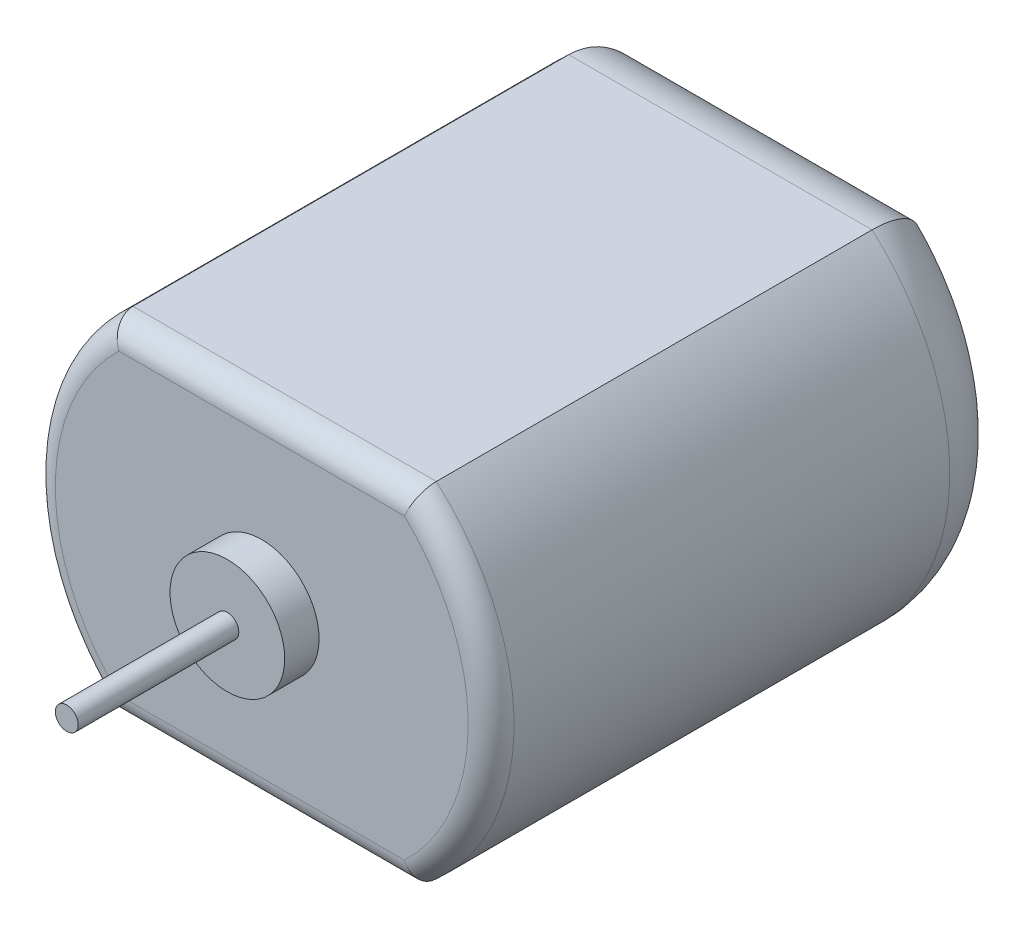
ISO-10303-21;
HEADER;
FILE_DESCRIPTION(('STEP AP214'),'2;1');
FILE_NAME('part.step','',(''),(''),'','','');
FILE_SCHEMA(('AUTOMOTIVE_DESIGN { 1 0 10303 214 1 1 1 1 }'));
ENDSEC;
DATA;
#1=APPLICATION_CONTEXT('core data for automotive mechanical design processes');
#2=APPLICATION_PROTOCOL_DEFINITION('international standard','automotive_design',2000,#1);
#3=PRODUCT_CONTEXT('',#1,'mechanical');
#4=PRODUCT('Part','Part','',(#3));
#5=PRODUCT_RELATED_PRODUCT_CATEGORY('part','',(#4));
#6=PRODUCT_DEFINITION_FORMATION('','',#4);
#7=PRODUCT_DEFINITION_CONTEXT('part definition',#1,'design');
#8=PRODUCT_DEFINITION('design','',#6,#7);
#9=PRODUCT_DEFINITION_SHAPE('','',#8);
#10=(LENGTH_UNIT() NAMED_UNIT(*) SI_UNIT(.MILLI.,.METRE.));
#11=(NAMED_UNIT(*) PLANE_ANGLE_UNIT() SI_UNIT($,.RADIAN.));
#12=(NAMED_UNIT(*) SI_UNIT($,.STERADIAN.) SOLID_ANGLE_UNIT());
#13=UNCERTAINTY_MEASURE_WITH_UNIT(LENGTH_MEASURE(1.E-05),#10,'distance_accuracy_value','');
#14=(GEOMETRIC_REPRESENTATION_CONTEXT(3) GLOBAL_UNCERTAINTY_ASSIGNED_CONTEXT((#13)) GLOBAL_UNIT_ASSIGNED_CONTEXT((#10,
#11,#12)) REPRESENTATION_CONTEXT('',''));
#15=CARTESIAN_POINT('',(0.,0.,0.));
#16=DIRECTION('',(0.,0.,1.));
#17=DIRECTION('',(1.,0.,0.));
#18=AXIS2_PLACEMENT_3D('',#15,#16,#17);
#19=CARTESIAN_POINT('',(0.,0.,0.));
#20=DIRECTION('',(0.,0.,1.));
#21=DIRECTION('',(1.,0.,0.));
#22=AXIS2_PLACEMENT_3D('',#19,#20,#21);
#23=PLANE('',#22);
#24=CARTESIAN_POINT('',(0.,0.,0.));
#25=DIRECTION('',(0.,0.,1.));
#26=DIRECTION('',(1.,0.,0.));
#27=AXIS2_PLACEMENT_3D('',#24,#25,#26);
#28=CIRCLE('',#27,7.);
#29=CARTESIAN_POINT('',(5.3619026473818,4.5,0.));
#30=VERTEX_POINT('',#29);
#31=CARTESIAN_POINT('',(5.3619026473818,-4.5,0.));
#32=VERTEX_POINT('',#31);
#33=EDGE_CURVE('E304',#30,#32,#28,.F.);
#34=ORIENTED_EDGE('',*,*,#33,.T.);
#35=DIRECTION('',(1.,0.,0.));
#36=VECTOR('',#35,1.);
#37=CARTESIAN_POINT('',(0.,-4.5,0.));
#38=LINE('',#37,#36);
#39=CARTESIAN_POINT('',(-5.3619026473818,-4.5,0.));
#40=VERTEX_POINT('',#39);
#41=EDGE_CURVE('E301',#32,#40,#38,.F.);
#42=ORIENTED_EDGE('',*,*,#41,.T.);
#43=CARTESIAN_POINT('',(0.,0.,0.));
#44=DIRECTION('',(0.,0.,1.));
#45=DIRECTION('',(1.,0.,0.));
#46=AXIS2_PLACEMENT_3D('',#43,#44,#45);
#47=CIRCLE('',#46,7.);
#48=CARTESIAN_POINT('',(-5.3619026473818,4.5,0.));
#49=VERTEX_POINT('',#48);
#50=EDGE_CURVE('E308',#40,#49,#47,.F.);
#51=ORIENTED_EDGE('',*,*,#50,.T.);
#52=DIRECTION('',(-1.,0.,0.));
#53=VECTOR('',#52,1.);
#54=CARTESIAN_POINT('',(0.,4.5,0.));
#55=LINE('',#54,#53);
#56=EDGE_CURVE('E306',#49,#30,#55,.F.);
#57=ORIENTED_EDGE('',*,*,#56,.T.);
#58=EDGE_LOOP('',(#34,#42,#51,#57));
#59=FACE_BOUND('',#58,.T.);
#60=CARTESIAN_POINT('',(0.,0.,0.));
#61=DIRECTION('',(0.,0.,-1.));
#62=DIRECTION('',(-1.,0.,0.));
#63=AXIS2_PLACEMENT_3D('',#60,#61,#62);
#64=CIRCLE('',#63,3.19234070505076);
#65=CARTESIAN_POINT('',(2.75858546553363,1.60662547174834,0.));
#66=VERTEX_POINT('',#65);
#67=CARTESIAN_POINT('',(-2.75858546553363,1.60662547174834,0.));
#68=VERTEX_POINT('',#67);
#69=EDGE_CURVE('E129',#66,#68,#64,.T.);
#70=ORIENTED_EDGE('',*,*,#69,.F.);
#71=DIRECTION('',(1.,0.,0.));
#72=VECTOR('',#71,1.);
#73=CARTESIAN_POINT('',(2.75858546553363,1.60662547174834,0.));
#74=LINE('',#73,#72);
#75=EDGE_CURVE('E134',#68,#66,#74,.T.);
#76=ORIENTED_EDGE('',*,*,#75,.F.);
#77=EDGE_LOOP('',(#70,#76));
#78=FACE_BOUND('',#77,.T.);
#79=ADVANCED_FACE('F39',(#59,#78),#23,.F.);
#80=CARTESIAN_POINT('',(0.,0.,23.));
#81=DIRECTION('',(0.,0.,-1.));
#82=DIRECTION('',(-1.,0.,0.));
#83=AXIS2_PLACEMENT_3D('',#80,#81,#82);
#84=CYLINDRICAL_SURFACE('',#83,10.);
#85=DIRECTION('',(0.,0.,-1.));
#86=VECTOR('',#85,1.);
#87=CARTESIAN_POINT('',(-6.61437827766148,7.5,23.));
#88=LINE('',#87,#86);
#89=CARTESIAN_POINT('',(-6.61437827766148,7.5,22.));
#90=VERTEX_POINT('',#89);
#91=CARTESIAN_POINT('',(-6.61437827766148,7.5,3.));
#92=VERTEX_POINT('',#91);
#93=EDGE_CURVE('E156',#90,#92,#88,.T.);
#94=ORIENTED_EDGE('',*,*,#93,.T.);
#95=CARTESIAN_POINT('',(0.,0.,3.));
#96=DIRECTION('',(0.,0.,1.));
#97=DIRECTION('',(1.,0.,0.));
#98=AXIS2_PLACEMENT_3D('',#95,#96,#97);
#99=CIRCLE('',#98,10.);
#100=CARTESIAN_POINT('',(-6.61437827766148,-7.5,3.));
#101=VERTEX_POINT('',#100);
#102=EDGE_CURVE('E290',#92,#101,#99,.T.);
#103=ORIENTED_EDGE('',*,*,#102,.T.);
#104=DIRECTION('',(0.,0.,-1.));
#105=VECTOR('',#104,1.);
#106=CARTESIAN_POINT('',(-6.61437827766148,-7.5,23.));
#107=LINE('',#106,#105);
#108=CARTESIAN_POINT('',(-6.61437827766148,-7.5,22.));
#109=VERTEX_POINT('',#108);
#110=EDGE_CURVE('E159',#109,#101,#107,.T.);
#111=ORIENTED_EDGE('',*,*,#110,.F.);
#112=CARTESIAN_POINT('',(0.,0.,22.));
#113=DIRECTION('',(0.,0.,1.));
#114=DIRECTION('',(1.,0.,0.));
#115=AXIS2_PLACEMENT_3D('',#112,#113,#114);
#116=CIRCLE('',#115,10.);
#117=EDGE_CURVE('E185',#109,#90,#116,.F.);
#118=ORIENTED_EDGE('',*,*,#117,.T.);
#119=EDGE_LOOP('',(#94,#103,#111,#118));
#120=FACE_BOUND('',#119,.T.);
#121=ADVANCED_FACE('F329',(#120),#84,.T.);
#122=CARTESIAN_POINT('',(6.61437827766148,-7.5,23.));
#123=DIRECTION('',(0.,1.,0.));
#124=DIRECTION('',(0.,0.,1.));
#125=AXIS2_PLACEMENT_3D('',#122,#123,#124);
#126=PLANE('',#125);
#127=ORIENTED_EDGE('',*,*,#110,.T.);
#128=DIRECTION('',(1.,0.,0.));
#129=VECTOR('',#128,1.);
#130=CARTESIAN_POINT('',(6.61437827766148,-7.5,3.));
#131=LINE('',#130,#129);
#132=CARTESIAN_POINT('',(6.61437827766147,-7.5,3.));
#133=VERTEX_POINT('',#132);
#134=EDGE_CURVE('E187',#101,#133,#131,.T.);
#135=ORIENTED_EDGE('',*,*,#134,.T.);
#136=DIRECTION('',(0.,0.,-1.));
#137=VECTOR('',#136,1.);
#138=CARTESIAN_POINT('',(6.61437827766147,-7.5,23.));
#139=LINE('',#138,#137);
#140=CARTESIAN_POINT('',(6.61437827766147,-7.5,22.));
#141=VERTEX_POINT('',#140);
#142=EDGE_CURVE('E165',#141,#133,#139,.T.);
#143=ORIENTED_EDGE('',*,*,#142,.F.);
#144=DIRECTION('',(1.,0.,0.));
#145=VECTOR('',#144,1.);
#146=CARTESIAN_POINT('',(-6.61437827766148,-7.5,22.));
#147=LINE('',#146,#145);
#148=EDGE_CURVE('E178',#141,#109,#147,.F.);
#149=ORIENTED_EDGE('',*,*,#148,.T.);
#150=EDGE_LOOP('',(#127,#135,#143,#149));
#151=FACE_BOUND('',#150,.T.);
#152=ADVANCED_FACE('F313',(#151),#126,.F.);
#153=CARTESIAN_POINT('',(0.,0.,23.));
#154=DIRECTION('',(0.,0.,-1.));
#155=DIRECTION('',(-1.,0.,0.));
#156=AXIS2_PLACEMENT_3D('',#153,#154,#155);
#157=CYLINDRICAL_SURFACE('',#156,10.);
#158=ORIENTED_EDGE('',*,*,#142,.T.);
#159=CARTESIAN_POINT('',(0.,0.,3.));
#160=DIRECTION('',(0.,0.,1.));
#161=DIRECTION('',(1.,0.,0.));
#162=AXIS2_PLACEMENT_3D('',#159,#160,#161);
#163=CIRCLE('',#162,10.);
#164=CARTESIAN_POINT('',(6.61437827766148,7.5,3.));
#165=VERTEX_POINT('',#164);
#166=EDGE_CURVE('E297',#133,#165,#163,.T.);
#167=ORIENTED_EDGE('',*,*,#166,.T.);
#168=DIRECTION('',(0.,0.,-1.));
#169=VECTOR('',#168,1.);
#170=CARTESIAN_POINT('',(6.61437827766148,7.5,23.));
#171=LINE('',#170,#169);
#172=CARTESIAN_POINT('',(6.61437827766148,7.5,22.));
#173=VERTEX_POINT('',#172);
#174=EDGE_CURVE('E162',#173,#165,#171,.T.);
#175=ORIENTED_EDGE('',*,*,#174,.F.);
#176=CARTESIAN_POINT('',(0.,0.,22.));
#177=DIRECTION('',(0.,0.,1.));
#178=DIRECTION('',(1.,0.,0.));
#179=AXIS2_PLACEMENT_3D('',#176,#177,#178);
#180=CIRCLE('',#179,10.);
#181=EDGE_CURVE('E181',#173,#141,#180,.F.);
#182=ORIENTED_EDGE('',*,*,#181,.T.);
#183=EDGE_LOOP('',(#158,#167,#175,#182));
#184=FACE_BOUND('',#183,.T.);
#185=ADVANCED_FACE('F318',(#184),#157,.T.);
#186=CARTESIAN_POINT('',(-6.61437827766148,7.5,23.));
#187=DIRECTION('',(0.,-1.,0.));
#188=DIRECTION('',(0.,0.,-1.));
#189=AXIS2_PLACEMENT_3D('',#186,#187,#188);
#190=PLANE('',#189);
#191=ORIENTED_EDGE('',*,*,#174,.T.);
#192=DIRECTION('',(-1.,0.,0.));
#193=VECTOR('',#192,1.);
#194=CARTESIAN_POINT('',(-6.61437827766148,7.5,3.));
#195=LINE('',#194,#193);
#196=EDGE_CURVE('E293',#165,#92,#195,.T.);
#197=ORIENTED_EDGE('',*,*,#196,.T.);
#198=ORIENTED_EDGE('',*,*,#93,.F.);
#199=DIRECTION('',(-1.,0.,0.));
#200=VECTOR('',#199,1.);
#201=CARTESIAN_POINT('',(6.61437827766148,7.5,22.));
#202=LINE('',#201,#200);
#203=EDGE_CURVE('E183',#90,#173,#202,.F.);
#204=ORIENTED_EDGE('',*,*,#203,.T.);
#205=EDGE_LOOP('',(#191,#197,#198,#204));
#206=FACE_BOUND('',#205,.T.);
#207=ADVANCED_FACE('F336',(#206),#190,.F.);
#208=CARTESIAN_POINT('',(0.,0.,23.));
#209=DIRECTION('',(0.,0.,1.));
#210=DIRECTION('',(1.,0.,0.));
#211=AXIS2_PLACEMENT_3D('',#208,#209,#210);
#212=PLANE('',#211);
#213=CARTESIAN_POINT('',(0.,0.,23.));
#214=DIRECTION('',(0.,0.,1.));
#215=DIRECTION('',(1.,0.,0.));
#216=AXIS2_PLACEMENT_3D('',#213,#214,#215);
#217=CIRCLE('',#216,9.);
#218=CARTESIAN_POINT('',(-6.22494979899436,6.5,23.));
#219=VERTEX_POINT('',#218);
#220=CARTESIAN_POINT('',(-6.22494979899436,-6.5,23.));
#221=VERTEX_POINT('',#220);
#222=EDGE_CURVE('E152',#219,#221,#217,.T.);
#223=ORIENTED_EDGE('',*,*,#222,.T.);
#224=DIRECTION('',(1.,0.,0.));
#225=VECTOR('',#224,1.);
#226=CARTESIAN_POINT('',(6.61437827766147,-6.5,23.));
#227=LINE('',#226,#225);
#228=CARTESIAN_POINT('',(6.22494979899436,-6.5,23.));
#229=VERTEX_POINT('',#228);
#230=EDGE_CURVE('E175',#221,#229,#227,.T.);
#231=ORIENTED_EDGE('',*,*,#230,.T.);
#232=CARTESIAN_POINT('',(0.,0.,23.));
#233=DIRECTION('',(0.,0.,1.));
#234=DIRECTION('',(1.,0.,0.));
#235=AXIS2_PLACEMENT_3D('',#232,#233,#234);
#236=CIRCLE('',#235,9.);
#237=CARTESIAN_POINT('',(6.22494979899436,6.5,23.));
#238=VERTEX_POINT('',#237);
#239=EDGE_CURVE('E173',#229,#238,#236,.T.);
#240=ORIENTED_EDGE('',*,*,#239,.T.);
#241=DIRECTION('',(-1.,0.,0.));
#242=VECTOR('',#241,1.);
#243=CARTESIAN_POINT('',(-6.61437827766148,6.5,23.));
#244=LINE('',#243,#242);
#245=EDGE_CURVE('E171',#238,#219,#244,.T.);
#246=ORIENTED_EDGE('',*,*,#245,.T.);
#247=EDGE_LOOP('',(#223,#231,#240,#246));
#248=FACE_BOUND('',#247,.T.);
#249=CARTESIAN_POINT('',(0.,0.,23.));
#250=DIRECTION('',(0.,0.,1.));
#251=DIRECTION('',(1.,0.,0.));
#252=AXIS2_PLACEMENT_3D('',#249,#250,#251);
#253=CIRCLE('',#252,2.5);
#254=CARTESIAN_POINT('',(2.5,0.,23.));
#255=VERTEX_POINT('',#254);
#256=EDGE_CURVE('E153',#255,#255,#253,.T.);
#257=ORIENTED_EDGE('',*,*,#256,.F.);
#258=EDGE_LOOP('',(#257));
#259=FACE_BOUND('',#258,.T.);
#260=ADVANCED_FACE('F342',(#248,#259),#212,.T.);
#261=CARTESIAN_POINT('',(0.,0.,24.5));
#262=DIRECTION('',(0.,0.,-1.));
#263=DIRECTION('',(-1.,0.,0.));
#264=AXIS2_PLACEMENT_3D('',#261,#262,#263);
#265=CYLINDRICAL_SURFACE('',#264,2.5);
#266=CARTESIAN_POINT('',(0.,0.,24.5));
#267=DIRECTION('',(0.,0.,1.));
#268=DIRECTION('',(1.,0.,0.));
#269=AXIS2_PLACEMENT_3D('',#266,#267,#268);
#270=CIRCLE('',#269,2.5);
#271=CARTESIAN_POINT('',(2.5,0.,24.5));
#272=VERTEX_POINT('',#271);
#273=EDGE_CURVE('E147',#272,#272,#270,.T.);
#274=ORIENTED_EDGE('',*,*,#273,.F.);
#275=EDGE_LOOP('',(#274));
#276=FACE_BOUND('',#275,.T.);
#277=ORIENTED_EDGE('',*,*,#256,.T.);
#278=EDGE_LOOP('',(#277));
#279=FACE_BOUND('',#278,.T.);
#280=ADVANCED_FACE('F345',(#276,#279),#265,.T.);
#281=CARTESIAN_POINT('',(0.,0.,24.5));
#282=DIRECTION('',(0.,0.,1.));
#283=DIRECTION('',(1.,0.,0.));
#284=AXIS2_PLACEMENT_3D('',#281,#282,#283);
#285=PLANE('',#284);
#286=CARTESIAN_POINT('',(0.,0.,24.5));
#287=DIRECTION('',(0.,0.,1.));
#288=DIRECTION('',(1.,0.,0.));
#289=AXIS2_PLACEMENT_3D('',#286,#287,#288);
#290=CIRCLE('',#289,0.5);
#291=CARTESIAN_POINT('',(0.5,0.,24.5));
#292=VERTEX_POINT('',#291);
#293=EDGE_CURVE('E149',#292,#292,#290,.T.);
#294=ORIENTED_EDGE('',*,*,#293,.F.);
#295=EDGE_LOOP('',(#294));
#296=FACE_BOUND('',#295,.T.);
#297=ORIENTED_EDGE('',*,*,#273,.T.);
#298=EDGE_LOOP('',(#297));
#299=FACE_BOUND('',#298,.T.);
#300=ADVANCED_FACE('F350',(#296,#299),#285,.T.);
#301=CARTESIAN_POINT('',(0.,0.,31.5));
#302=DIRECTION('',(0.,0.,-1.));
#303=DIRECTION('',(-1.,0.,0.));
#304=AXIS2_PLACEMENT_3D('',#301,#302,#303);
#305=CYLINDRICAL_SURFACE('',#304,0.5);
#306=CARTESIAN_POINT('',(0.,0.,31.5));
#307=DIRECTION('',(0.,0.,1.));
#308=DIRECTION('',(1.,0.,0.));
#309=AXIS2_PLACEMENT_3D('',#306,#307,#308);
#310=CIRCLE('',#309,0.5);
#311=CARTESIAN_POINT('',(0.5,0.,31.5));
#312=VERTEX_POINT('',#311);
#313=EDGE_CURVE('E144',#312,#312,#310,.T.);
#314=ORIENTED_EDGE('',*,*,#313,.F.);
#315=EDGE_LOOP('',(#314));
#316=FACE_BOUND('',#315,.T.);
#317=ORIENTED_EDGE('',*,*,#293,.T.);
#318=EDGE_LOOP('',(#317));
#319=FACE_BOUND('',#318,.T.);
#320=ADVANCED_FACE('F356',(#316,#319),#305,.T.);
#321=CARTESIAN_POINT('',(0.,0.,31.5));
#322=DIRECTION('',(0.,0.,1.));
#323=DIRECTION('',(1.,0.,0.));
#324=AXIS2_PLACEMENT_3D('',#321,#322,#323);
#325=PLANE('',#324);
#326=ORIENTED_EDGE('',*,*,#313,.T.);
#327=EDGE_LOOP('',(#326));
#328=FACE_BOUND('',#327,.T.);
#329=ADVANCED_FACE('F231',(#328),#325,.T.);
#330=CARTESIAN_POINT('',(0.,6.5,22.));
#331=DIRECTION('',(1.,0.,0.));
#332=DIRECTION('',(0.,0.,-1.));
#333=AXIS2_PLACEMENT_3D('',#330,#331,#332);
#334=CYLINDRICAL_SURFACE('',#333,1.);
#335=CARTESIAN_POINT('',(6.61437827766148,7.5,22.));
#336=CARTESIAN_POINT('',(6.61437842210405,7.50000070775486,22.0268030740604));
#337=CARTESIAN_POINT('',(6.61397070938767,7.49892164208524,22.0535928341524));
#338=CARTESIAN_POINT('',(6.61234564054267,7.49462277672622,22.1069707050066));
#339=CARTESIAN_POINT('',(6.61112842469291,7.49140334794055,22.1335588498995));
#340=CARTESIAN_POINT('',(6.60628204016919,7.47859025944818,22.2125990543511));
#341=CARTESIAN_POINT('',(6.60145803941141,7.46584151209883,22.2645050293058));
#342=CARTESIAN_POINT('',(6.58878872253936,7.43241945200209,22.3652610470786));
#343=CARTESIAN_POINT('',(6.58094379846614,7.41174716753527,22.4141114854738));
#344=CARTESIAN_POINT('',(6.56248668410333,7.36322931625037,22.5075492341123));
#345=CARTESIAN_POINT('',(6.55187375550575,7.33538183562103,22.5521354026067));
#346=CARTESIAN_POINT('',(6.52789298757729,7.27264796246685,22.6370836824597));
#347=CARTESIAN_POINT('',(6.5144608992878,7.23759790181229,22.6773064343941));
#348=CARTESIAN_POINT('',(6.48540284017042,7.16204782264177,22.7513264250274));
#349=CARTESIAN_POINT('',(6.46977617523093,7.12154608000981,22.785121622795));
#350=CARTESIAN_POINT('',(6.43571904228457,7.03363450295053,22.8475351466267));
#351=CARTESIAN_POINT('',(6.41717541093012,6.98595337277782,22.875709029581));
#352=CARTESIAN_POINT('',(6.37855287997911,6.88711287674907,22.9236673412623));
#353=CARTESIAN_POINT('',(6.35847359511584,6.83595263840904,22.9434496564989));
#354=CARTESIAN_POINT('',(6.32008383207697,6.73862844503145,22.9722513830427));
#355=CARTESIAN_POINT('',(6.30190425530877,6.69273143074326,22.9823687614689));
#356=CARTESIAN_POINT('',(6.26509673268577,6.60021995208261,22.9960597835253));
#357=CARTESIAN_POINT('',(6.24646973591242,6.55360707098906,22.9996462195082));
#358=CARTESIAN_POINT('',(6.22683898090258,6.5047045566649,22.9999917192456));
#359=CARTESIAN_POINT('',(6.22589445404307,6.50235216794491,23.0000000200304));
#360=CARTESIAN_POINT('',(6.22494979899436,6.5,23.));
#361=B_SPLINE_CURVE_WITH_KNOTS('',3,(#335,#336,#337,#338,#339,#340,#341,#342,#343,#344,#345,
#346,#347,#348,#349,#350,#351,#352,#353,#354,#355,#356,#357,#358,#359,#360),.UNSPECIFIED.,.F.,
.F.,(4,2,2,2,2,2,2,2,2,2,2,2,4),(0.,0.0803582131555719,0.16070250465756,0.320863669673694,
0.481004056736595,0.641187201698183,0.805520254521724,0.969905400968539,1.14436927926721,
1.31887707178089,1.46964837101099,1.62012403101409,1.62772879347805),.UNSPECIFIED.);
#362=EDGE_CURVE('E215',#173,#238,#361,.T.);
#363=ORIENTED_EDGE('',*,*,#362,.F.);
#364=ORIENTED_EDGE('',*,*,#203,.F.);
#365=CARTESIAN_POINT('',(-6.61437827766148,7.5,22.));
#366=CARTESIAN_POINT('',(-6.61437842210405,7.50000070775486,22.0268030740604));
#367=CARTESIAN_POINT('',(-6.61397070938767,7.49892164208524,22.0535928341524));
#368=CARTESIAN_POINT('',(-6.61234564054267,7.49462277672622,22.1069707050066));
#369=CARTESIAN_POINT('',(-6.61112842469291,7.49140334794055,22.1335588498995));
#370=CARTESIAN_POINT('',(-6.60628204016919,7.47859025944818,22.2125990543511));
#371=CARTESIAN_POINT('',(-6.60145803941141,7.46584151209883,22.2645050293058));
#372=CARTESIAN_POINT('',(-6.58878872253936,7.43241945200209,22.3652610470786));
#373=CARTESIAN_POINT('',(-6.58094379846614,7.41174716753527,22.4141114854738));
#374=CARTESIAN_POINT('',(-6.56248668410333,7.36322931625037,22.5075492341123));
#375=CARTESIAN_POINT('',(-6.55187375550575,7.33538183562103,22.5521354026067));
#376=CARTESIAN_POINT('',(-6.52789298757729,7.27264796246685,22.6370836824597));
#377=CARTESIAN_POINT('',(-6.5144608992878,7.23759790181229,22.6773064343941));
#378=CARTESIAN_POINT('',(-6.48540284017042,7.16204782264177,22.7513264250274));
#379=CARTESIAN_POINT('',(-6.46977617523093,7.12154608000981,22.785121622795));
#380=CARTESIAN_POINT('',(-6.43571904228457,7.03363450295053,22.8475351466267));
#381=CARTESIAN_POINT('',(-6.41717541093012,6.98595337277782,22.875709029581));
#382=CARTESIAN_POINT('',(-6.37855287997911,6.88711287674907,22.9236673412623));
#383=CARTESIAN_POINT('',(-6.35847359511584,6.83595263840904,22.9434496564989));
#384=CARTESIAN_POINT('',(-6.32008383207697,6.73862844503145,22.9722513830427));
#385=CARTESIAN_POINT('',(-6.30190425530877,6.69273143074326,22.9823687614689));
#386=CARTESIAN_POINT('',(-6.26509673268577,6.60021995208261,22.9960597835253));
#387=CARTESIAN_POINT('',(-6.24646973591242,6.55360707098906,22.9996462195082));
#388=CARTESIAN_POINT('',(-6.22683898090258,6.5047045566649,22.9999917192456));
#389=CARTESIAN_POINT('',(-6.22589445404307,6.50235216794491,23.0000000200304));
#390=CARTESIAN_POINT('',(-6.22494979899436,6.5,23.));
#391=B_SPLINE_CURVE_WITH_KNOTS('',3,(#365,#366,#367,#368,#369,#370,#371,#372,#373,#374,#375,
#376,#377,#378,#379,#380,#381,#382,#383,#384,#385,#386,#387,#388,#389,#390),.UNSPECIFIED.,.F.,
.F.,(4,2,2,2,2,2,2,2,2,2,2,2,4),(0.,0.0803582131555719,0.16070250465756,0.320863669673694,
0.481004056736595,0.641187201698183,0.805520254521724,0.969905400968539,1.14436927926721,
1.31887707178089,1.46964837101099,1.62012403101409,1.62772879347805),.UNSPECIFIED.);
#392=EDGE_CURVE('E148',#219,#90,#391,.F.);
#393=ORIENTED_EDGE('',*,*,#392,.F.);
#394=ORIENTED_EDGE('',*,*,#245,.F.);
#395=EDGE_LOOP('',(#363,#364,#393,#394));
#396=FACE_BOUND('',#395,.T.);
#397=ADVANCED_FACE('F227',(#396),#334,.T.);
#398=CARTESIAN_POINT('',(0.,0.,22.));
#399=DIRECTION('',(0.,0.,1.));
#400=DIRECTION('',(1.,0.,0.));
#401=AXIS2_PLACEMENT_3D('',#398,#399,#400);
#402=TOROIDAL_SURFACE('',#401,9.,1.);
#403=ORIENTED_EDGE('',*,*,#392,.T.);
#404=ORIENTED_EDGE('',*,*,#117,.F.);
#405=CARTESIAN_POINT('',(-6.61437827766148,-7.5,22.));
#406=CARTESIAN_POINT('',(-6.61437842210405,-7.50000070775486,22.0268030740604));
#407=CARTESIAN_POINT('',(-6.61397070938767,-7.49892164208524,22.0535928341524));
#408=CARTESIAN_POINT('',(-6.61234564054267,-7.49462277672622,22.1069707050066));
#409=CARTESIAN_POINT('',(-6.61112842469291,-7.49140334794055,22.1335588498995));
#410=CARTESIAN_POINT('',(-6.60628204016919,-7.47859025944818,22.2125990543511));
#411=CARTESIAN_POINT('',(-6.60145803941141,-7.46584151209883,22.2645050293058));
#412=CARTESIAN_POINT('',(-6.58878872253936,-7.43241945200209,22.3652610470786));
#413=CARTESIAN_POINT('',(-6.58094379846614,-7.41174716753527,22.4141114854738));
#414=CARTESIAN_POINT('',(-6.56248668410333,-7.36322931625037,22.5075492341123));
#415=CARTESIAN_POINT('',(-6.55187375550575,-7.33538183562103,22.5521354026067));
#416=CARTESIAN_POINT('',(-6.52789298757729,-7.27264796246685,22.6370836824597));
#417=CARTESIAN_POINT('',(-6.5144608992878,-7.23759790181229,22.6773064343941));
#418=CARTESIAN_POINT('',(-6.48540284017042,-7.16204782264177,22.7513264250274));
#419=CARTESIAN_POINT('',(-6.46977617523093,-7.12154608000981,22.785121622795));
#420=CARTESIAN_POINT('',(-6.43571904228457,-7.03363450295053,22.8475351466267));
#421=CARTESIAN_POINT('',(-6.41717541093012,-6.98595337277782,22.875709029581));
#422=CARTESIAN_POINT('',(-6.37855287997911,-6.88711287674907,22.9236673412623));
#423=CARTESIAN_POINT('',(-6.35847359511584,-6.83595263840904,22.9434496564989));
#424=CARTESIAN_POINT('',(-6.32008383207697,-6.73862844503145,22.9722513830427));
#425=CARTESIAN_POINT('',(-6.30190425530877,-6.69273143074326,22.9823687614689));
#426=CARTESIAN_POINT('',(-6.26509673268577,-6.60021995208261,22.9960597835253));
#427=CARTESIAN_POINT('',(-6.24646973591242,-6.55360707098906,22.9996462195082));
#428=CARTESIAN_POINT('',(-6.22683898090258,-6.5047045566649,22.9999917192456));
#429=CARTESIAN_POINT('',(-6.22589445404307,-6.50235216794491,23.0000000200304));
#430=CARTESIAN_POINT('',(-6.22494979899436,-6.5,23.));
#431=B_SPLINE_CURVE_WITH_KNOTS('',3,(#405,#406,#407,#408,#409,#410,#411,#412,#413,#414,#415,
#416,#417,#418,#419,#420,#421,#422,#423,#424,#425,#426,#427,#428,#429,#430),.UNSPECIFIED.,.F.,
.F.,(4,2,2,2,2,2,2,2,2,2,2,2,4),(0.,0.0803582131555719,0.16070250465756,0.320863669673694,
0.481004056736595,0.641187201698183,0.805520254521724,0.969905400968539,1.14436927926721,
1.31887707178089,1.46964837101099,1.62012403101409,1.62772879347805),.UNSPECIFIED.);
#432=EDGE_CURVE('E196',#221,#109,#431,.F.);
#433=ORIENTED_EDGE('',*,*,#432,.F.);
#434=ORIENTED_EDGE('',*,*,#222,.F.);
#435=EDGE_LOOP('',(#403,#404,#433,#434));
#436=FACE_BOUND('',#435,.T.);
#437=ADVANCED_FACE('F210',(#436),#402,.T.);
#438=CARTESIAN_POINT('',(0.,0.,22.));
#439=DIRECTION('',(0.,0.,1.));
#440=DIRECTION('',(1.,0.,0.));
#441=AXIS2_PLACEMENT_3D('',#438,#439,#440);
#442=TOROIDAL_SURFACE('',#441,9.,1.);
#443=ORIENTED_EDGE('',*,*,#362,.T.);
#444=ORIENTED_EDGE('',*,*,#239,.F.);
#445=CARTESIAN_POINT('',(6.61437827766147,-7.5,22.));
#446=CARTESIAN_POINT('',(6.61437842210405,-7.50000070775486,22.0268030740604));
#447=CARTESIAN_POINT('',(6.61397070938767,-7.49892164208524,22.0535928341524));
#448=CARTESIAN_POINT('',(6.61234564054267,-7.49462277672622,22.1069707050066));
#449=CARTESIAN_POINT('',(6.61112842469292,-7.49140334794055,22.1335588498995));
#450=CARTESIAN_POINT('',(6.60628204016919,-7.47859025944818,22.2125990543511));
#451=CARTESIAN_POINT('',(6.60145803941141,-7.46584151209883,22.2645050293058));
#452=CARTESIAN_POINT('',(6.58878872253936,-7.43241945200209,22.3652610470786));
#453=CARTESIAN_POINT('',(6.58094379846615,-7.41174716753527,22.4141114854738));
#454=CARTESIAN_POINT('',(6.56248668410333,-7.36322931625037,22.5075492341123));
#455=CARTESIAN_POINT('',(6.55187375550575,-7.33538183562103,22.5521354026067));
#456=CARTESIAN_POINT('',(6.52789298757729,-7.27264796246685,22.6370836824597));
#457=CARTESIAN_POINT('',(6.5144608992878,-7.23759790181229,22.6773064343941));
#458=CARTESIAN_POINT('',(6.48540284017042,-7.16204782264177,22.7513264250274));
#459=CARTESIAN_POINT('',(6.46977617523093,-7.12154608000981,22.785121622795));
#460=CARTESIAN_POINT('',(6.43571904228457,-7.03363450295053,22.8475351466267));
#461=CARTESIAN_POINT('',(6.41717541093012,-6.98595337277782,22.875709029581));
#462=CARTESIAN_POINT('',(6.37855287997911,-6.88711287674907,22.9236673412623));
#463=CARTESIAN_POINT('',(6.35847359511583,-6.83595263840905,22.9434496564989));
#464=CARTESIAN_POINT('',(6.32008383207698,-6.73862844503144,22.9722513830427));
#465=CARTESIAN_POINT('',(6.30190425530881,-6.69273143074324,22.9823687614689));
#466=CARTESIAN_POINT('',(6.26509673268573,-6.60021995208262,22.9960597835253));
#467=CARTESIAN_POINT('',(6.24646973591228,-6.55360707098911,22.9996462195082));
#468=CARTESIAN_POINT('',(6.22683898090256,-6.5047045566649,22.9999917192456));
#469=CARTESIAN_POINT('',(6.22589445404306,-6.50235216794491,23.0000000200304));
#470=CARTESIAN_POINT('',(6.22494979899436,-6.5,23.));
#471=B_SPLINE_CURVE_WITH_KNOTS('',3,(#445,#446,#447,#448,#449,#450,#451,#452,#453,#454,#455,
#456,#457,#458,#459,#460,#461,#462,#463,#464,#465,#466,#467,#468,#469,#470),.UNSPECIFIED.,.F.,
.F.,(4,2,2,2,2,2,2,2,2,2,2,2,4),(0.,0.0803582131555684,0.16070250465756,0.320863669673694,
0.481004056736595,0.641187201698183,0.805520254521723,0.969905400968539,1.14436927926721,
1.31887707178089,1.46964837101099,1.62012403101409,1.62772879347805),.UNSPECIFIED.);
#472=EDGE_CURVE('E188',#141,#229,#471,.T.);
#473=ORIENTED_EDGE('',*,*,#472,.F.);
#474=ORIENTED_EDGE('',*,*,#181,.F.);
#475=EDGE_LOOP('',(#443,#444,#473,#474));
#476=FACE_BOUND('',#475,.T.);
#477=ADVANCED_FACE('F207',(#476),#442,.T.);
#478=CARTESIAN_POINT('',(0.,-6.5,22.));
#479=DIRECTION('',(-1.,0.,0.));
#480=DIRECTION('',(0.,0.,1.));
#481=AXIS2_PLACEMENT_3D('',#478,#479,#480);
#482=CYLINDRICAL_SURFACE('',#481,1.);
#483=ORIENTED_EDGE('',*,*,#432,.T.);
#484=ORIENTED_EDGE('',*,*,#148,.F.);
#485=ORIENTED_EDGE('',*,*,#472,.T.);
#486=ORIENTED_EDGE('',*,*,#230,.F.);
#487=EDGE_LOOP('',(#483,#484,#485,#486));
#488=FACE_BOUND('',#487,.T.);
#489=ADVANCED_FACE('F204',(#488),#482,.T.);
#490=CARTESIAN_POINT('',(-6.61437827766148,4.5,3.));
#491=DIRECTION('',(-1.,0.,0.));
#492=DIRECTION('',(0.,0.,1.));
#493=AXIS2_PLACEMENT_3D('',#490,#491,#492);
#494=CYLINDRICAL_SURFACE('',#493,3.);
#495=CARTESIAN_POINT('',(6.61437827766148,7.5,3.));
#496=CARTESIAN_POINT('',(6.61438089711557,7.50001065237719,2.91974129677748));
#497=CARTESIAN_POINT('',(6.61316098831216,7.49677945199756,2.83948782628455));
#498=CARTESIAN_POINT('',(6.60829674839042,7.48391501598369,2.67958215168963));
#499=CARTESIAN_POINT('',(6.60465280659635,7.4742828084163,2.59992985311067));
#500=CARTESIAN_POINT('',(6.59497213826316,7.44872705953476,2.44197091842599));
#501=CARTESIAN_POINT('',(6.58894086984398,7.43281786948537,2.36366163495387));
#502=CARTESIAN_POINT('',(6.57453114161798,7.39488167008812,2.20878168433979));
#503=CARTESIAN_POINT('',(6.56615266060701,7.37285460547288,2.13221103291098));
#504=CARTESIAN_POINT('',(6.53756885552087,7.29788746549772,1.90592141390618));
#505=CARTESIAN_POINT('',(6.51390563783921,7.2360360367229,1.75946990527275));
#506=CARTESIAN_POINT('',(6.45797522988556,7.09093328812308,1.47947996205516));
#507=CARTESIAN_POINT('',(6.42570611779363,7.00767718847697,1.34594442087995));
#508=CARTESIAN_POINT('',(6.3524367425382,6.8204162448656,1.0918193667217));
#509=CARTESIAN_POINT('',(6.31124668358703,6.71596410370706,0.971614341525424));
#510=CARTESIAN_POINT('',(6.22153048143392,6.4910862431531,0.750450713773028));
#511=CARTESIAN_POINT('',(6.17300234194572,6.3706561781438,0.649497365484664));
#512=CARTESIAN_POINT('',(6.06645683671531,6.10977898103353,0.46310463613895));
#513=CARTESIAN_POINT('',(6.00804329933791,5.96856207458035,0.378971057190533));
#514=CARTESIAN_POINT('',(5.88523123678406,5.67643584500728,0.235494056444307));
#515=CARTESIAN_POINT('',(5.82083026032197,5.52552256002477,0.176160843152402));
#516=CARTESIAN_POINT('',(5.6928912372995,5.23105267770871,0.0867127456439242));
#517=CARTESIAN_POINT('',(5.62973206222385,5.08793744269847,0.0545681023797194));
#518=CARTESIAN_POINT('',(5.50043124519766,4.8001160777803,0.0115157269256712));
#519=CARTESIAN_POINT('',(5.43429562873955,4.65541357403447,0.000566904328327853));
#520=CARTESIAN_POINT('',(5.36542798752529,4.50756286613625,7.13218261032609E-06));
#521=CARTESIAN_POINT('',(5.36366564659822,4.5037812004739,-1.73816043331068E-08));
#522=CARTESIAN_POINT('',(5.3619026473818,4.5,0.));
#523=B_SPLINE_CURVE_WITH_KNOTS('',3,(#495,#496,#497,#498,#499,#500,#501,#502,#503,#504,#505,
#506,#507,#508,#509,#510,#511,#512,#513,#514,#515,#516,#517,#518,#519,#520,#521,#522),
.UNSPECIFIED.,.F.,.F.,(4,2,2,2,2,2,2,2,2,2,2,2,2,4),(0.,0.240692780134945,0.481346911902001,
0.721453987517645,0.961563232272681,1.44131597574978,1.92117594475226,2.41247478495634,
2.90390752168917,3.4250310336882,3.9463688435722,4.42407459823595,4.90085333719839,
4.9133697773285),.UNSPECIFIED.);
#524=EDGE_CURVE('E252',#30,#165,#523,.F.);
#525=ORIENTED_EDGE('',*,*,#524,.F.);
#526=ORIENTED_EDGE('',*,*,#56,.F.);
#527=CARTESIAN_POINT('',(-6.61437827766148,7.5,3.));
#528=CARTESIAN_POINT('',(-6.61438089711557,7.50001065237719,2.91974129677748));
#529=CARTESIAN_POINT('',(-6.61316098831216,7.49677945199756,2.83948782628455));
#530=CARTESIAN_POINT('',(-6.60829674839042,7.48391501598369,2.67958215168963));
#531=CARTESIAN_POINT('',(-6.60465280659635,7.4742828084163,2.59992985311067));
#532=CARTESIAN_POINT('',(-6.59497213826316,7.44872705953476,2.44197091842599));
#533=CARTESIAN_POINT('',(-6.58894086984398,7.43281786948537,2.36366163495387));
#534=CARTESIAN_POINT('',(-6.57453114161798,7.39488167008812,2.20878168433979));
#535=CARTESIAN_POINT('',(-6.56615266060701,7.37285460547288,2.13221103291098));
#536=CARTESIAN_POINT('',(-6.53756885552087,7.29788746549772,1.90592141390618));
#537=CARTESIAN_POINT('',(-6.51390563783921,7.2360360367229,1.75946990527275));
#538=CARTESIAN_POINT('',(-6.45797522988556,7.09093328812308,1.47947996205516));
#539=CARTESIAN_POINT('',(-6.42570611779363,7.00767718847697,1.34594442087995));
#540=CARTESIAN_POINT('',(-6.3524367425382,6.8204162448656,1.0918193667217));
#541=CARTESIAN_POINT('',(-6.31124668358703,6.71596410370706,0.971614341525424));
#542=CARTESIAN_POINT('',(-6.22153048143392,6.4910862431531,0.750450713773028));
#543=CARTESIAN_POINT('',(-6.17300234194572,6.3706561781438,0.649497365484664));
#544=CARTESIAN_POINT('',(-6.06645683671531,6.10977898103353,0.46310463613895));
#545=CARTESIAN_POINT('',(-6.00804329933791,5.96856207458035,0.378971057190533));
#546=CARTESIAN_POINT('',(-5.88523123678406,5.67643584500728,0.235494056444307));
#547=CARTESIAN_POINT('',(-5.82083026032197,5.52552256002477,0.176160843152402));
#548=CARTESIAN_POINT('',(-5.6928912372995,5.23105267770871,0.0867127456439242));
#549=CARTESIAN_POINT('',(-5.62973206222385,5.08793744269847,0.0545681023797194));
#550=CARTESIAN_POINT('',(-5.50043124519766,4.8001160777803,0.0115157269256712));
#551=CARTESIAN_POINT('',(-5.43429562873955,4.65541357403447,0.000566904328327853));
#552=CARTESIAN_POINT('',(-5.36542798752529,4.50756286613625,7.13218261032609E-06));
#553=CARTESIAN_POINT('',(-5.36366564659822,4.5037812004739,-1.73816043331068E-08));
#554=CARTESIAN_POINT('',(-5.3619026473818,4.5,0.));
#555=B_SPLINE_CURVE_WITH_KNOTS('',3,(#527,#528,#529,#530,#531,#532,#533,#534,#535,#536,#537,
#538,#539,#540,#541,#542,#543,#544,#545,#546,#547,#548,#549,#550,#551,#552,#553,#554),
.UNSPECIFIED.,.F.,.F.,(4,2,2,2,2,2,2,2,2,2,2,2,2,4),(0.,0.240692780134945,0.481346911902001,
0.721453987517645,0.961563232272681,1.44131597574978,1.92117594475226,2.41247478495634,
2.90390752168917,3.4250310336882,3.9463688435722,4.42407459823595,4.90085333719839,
4.9133697773285),.UNSPECIFIED.);
#556=EDGE_CURVE('E197',#92,#49,#555,.T.);
#557=ORIENTED_EDGE('',*,*,#556,.F.);
#558=ORIENTED_EDGE('',*,*,#196,.F.);
#559=EDGE_LOOP('',(#525,#526,#557,#558));
#560=FACE_BOUND('',#559,.T.);
#561=ADVANCED_FACE('F270',(#560),#494,.T.);
#562=CARTESIAN_POINT('',(0.,0.,3.));
#563=DIRECTION('',(0.,0.,1.));
#564=DIRECTION('',(1.,0.,0.));
#565=AXIS2_PLACEMENT_3D('',#562,#563,#564);
#566=TOROIDAL_SURFACE('',#565,7.,3.);
#567=ORIENTED_EDGE('',*,*,#556,.T.);
#568=ORIENTED_EDGE('',*,*,#50,.F.);
#569=CARTESIAN_POINT('',(-6.61437827766148,-7.5,3.));
#570=CARTESIAN_POINT('',(-6.61438089711557,-7.50001065237719,2.91974129677748));
#571=CARTESIAN_POINT('',(-6.61316098831216,-7.49677945199756,2.83948782628455));
#572=CARTESIAN_POINT('',(-6.60829674839042,-7.48391501598369,2.67958215168963));
#573=CARTESIAN_POINT('',(-6.60465280659635,-7.4742828084163,2.59992985311067));
#574=CARTESIAN_POINT('',(-6.59497213826316,-7.44872705953476,2.44197091842599));
#575=CARTESIAN_POINT('',(-6.58894086984398,-7.43281786948537,2.36366163495387));
#576=CARTESIAN_POINT('',(-6.57453114161798,-7.39488167008812,2.20878168433979));
#577=CARTESIAN_POINT('',(-6.56615266060701,-7.37285460547288,2.13221103291098));
#578=CARTESIAN_POINT('',(-6.53756885552087,-7.29788746549772,1.90592141390618));
#579=CARTESIAN_POINT('',(-6.51390563783921,-7.2360360367229,1.75946990527275));
#580=CARTESIAN_POINT('',(-6.45797522988556,-7.09093328812308,1.47947996205516));
#581=CARTESIAN_POINT('',(-6.42570611779363,-7.00767718847697,1.34594442087995));
#582=CARTESIAN_POINT('',(-6.3524367425382,-6.8204162448656,1.0918193667217));
#583=CARTESIAN_POINT('',(-6.31124668358703,-6.71596410370706,0.971614341525424));
#584=CARTESIAN_POINT('',(-6.22153048143392,-6.4910862431531,0.750450713773028));
#585=CARTESIAN_POINT('',(-6.17300234194572,-6.3706561781438,0.649497365484664));
#586=CARTESIAN_POINT('',(-6.06645683671531,-6.10977898103353,0.46310463613895));
#587=CARTESIAN_POINT('',(-6.00804329933791,-5.96856207458035,0.378971057190533));
#588=CARTESIAN_POINT('',(-5.88523123678406,-5.67643584500728,0.235494056444307));
#589=CARTESIAN_POINT('',(-5.82083026032197,-5.52552256002477,0.176160843152402));
#590=CARTESIAN_POINT('',(-5.6928912372995,-5.23105267770871,0.0867127456439242));
#591=CARTESIAN_POINT('',(-5.62973206222385,-5.08793744269847,0.0545681023797194));
#592=CARTESIAN_POINT('',(-5.50043124519766,-4.8001160777803,0.0115157269256712));
#593=CARTESIAN_POINT('',(-5.43429562873955,-4.65541357403447,0.000566904328327853));
#594=CARTESIAN_POINT('',(-5.36542798752529,-4.50756286613625,7.13218261032609E-06));
#595=CARTESIAN_POINT('',(-5.36366564659822,-4.5037812004739,-1.73816043331068E-08));
#596=CARTESIAN_POINT('',(-5.3619026473818,-4.5,0.));
#597=B_SPLINE_CURVE_WITH_KNOTS('',3,(#569,#570,#571,#572,#573,#574,#575,#576,#577,#578,#579,
#580,#581,#582,#583,#584,#585,#586,#587,#588,#589,#590,#591,#592,#593,#594,#595,#596),
.UNSPECIFIED.,.F.,.F.,(4,2,2,2,2,2,2,2,2,2,2,2,2,4),(0.,0.240692780134945,0.481346911902001,
0.721453987517645,0.961563232272681,1.44131597574978,1.92117594475226,2.41247478495634,
2.90390752168917,3.4250310336882,3.9463688435722,4.42407459823595,4.90085333719839,
4.9133697773285),.UNSPECIFIED.);
#598=EDGE_CURVE('E260',#101,#40,#597,.T.);
#599=ORIENTED_EDGE('',*,*,#598,.F.);
#600=ORIENTED_EDGE('',*,*,#102,.F.);
#601=EDGE_LOOP('',(#567,#568,#599,#600));
#602=FACE_BOUND('',#601,.T.);
#603=ADVANCED_FACE('F239',(#602),#566,.T.);
#604=CARTESIAN_POINT('',(0.,0.,3.));
#605=DIRECTION('',(0.,0.,1.));
#606=DIRECTION('',(1.,0.,0.));
#607=AXIS2_PLACEMENT_3D('',#604,#605,#606);
#608=TOROIDAL_SURFACE('',#607,7.,3.);
#609=ORIENTED_EDGE('',*,*,#524,.T.);
#610=ORIENTED_EDGE('',*,*,#166,.F.);
#611=CARTESIAN_POINT('',(6.61437827766147,-7.5,3.));
#612=CARTESIAN_POINT('',(6.61438089711557,-7.50001065237719,2.91974129677748));
#613=CARTESIAN_POINT('',(6.61316098831216,-7.49677945199756,2.83948782628455));
#614=CARTESIAN_POINT('',(6.60829674839042,-7.48391501598369,2.67958215168963));
#615=CARTESIAN_POINT('',(6.60465280659635,-7.4742828084163,2.59992985311067));
#616=CARTESIAN_POINT('',(6.59497213826316,-7.44872705953476,2.44197091842599));
#617=CARTESIAN_POINT('',(6.58894086984399,-7.43281786948537,2.36366163495387));
#618=CARTESIAN_POINT('',(6.57453114161799,-7.39488167008812,2.20878168433979));
#619=CARTESIAN_POINT('',(6.56615266060701,-7.37285460547288,2.13221103291098));
#620=CARTESIAN_POINT('',(6.53756885552087,-7.29788746549772,1.90592141390618));
#621=CARTESIAN_POINT('',(6.51390563783921,-7.2360360367229,1.75946990527275));
#622=CARTESIAN_POINT('',(6.45797522988556,-7.09093328812308,1.47947996205516));
#623=CARTESIAN_POINT('',(6.42570611779363,-7.00767718847697,1.34594442087995));
#624=CARTESIAN_POINT('',(6.3524367425382,-6.8204162448656,1.0918193667217));
#625=CARTESIAN_POINT('',(6.31124668358702,-6.71596410370706,0.971614341525424));
#626=CARTESIAN_POINT('',(6.22153048143392,-6.4910862431531,0.750450713773028));
#627=CARTESIAN_POINT('',(6.17300234194572,-6.3706561781438,0.649497365484664));
#628=CARTESIAN_POINT('',(6.06645683671531,-6.10977898103353,0.46310463613895));
#629=CARTESIAN_POINT('',(6.0080432993379,-5.96856207458035,0.378971057190533));
#630=CARTESIAN_POINT('',(5.88523123678405,-5.67643584500728,0.235494056444307));
#631=CARTESIAN_POINT('',(5.82083026032197,-5.52552256002477,0.176160843152402));
#632=CARTESIAN_POINT('',(5.6928912372995,-5.23105267770871,0.0867127456439241));
#633=CARTESIAN_POINT('',(5.62973206222385,-5.08793744269847,0.0545681023797195));
#634=CARTESIAN_POINT('',(5.50043124519767,-4.80011607778029,0.0115157269256706));
#635=CARTESIAN_POINT('',(5.43429562873955,-4.65541357403447,0.000566904328326431));
#636=CARTESIAN_POINT('',(5.36542798752529,-4.50756286613625,7.13218261025252E-06));
#637=CARTESIAN_POINT('',(5.36366564659822,-4.5037812004739,-1.73816043706715E-08));
#638=CARTESIAN_POINT('',(5.3619026473818,-4.5,0.));
#639=B_SPLINE_CURVE_WITH_KNOTS('',3,(#611,#612,#613,#614,#615,#616,#617,#618,#619,#620,#621,
#622,#623,#624,#625,#626,#627,#628,#629,#630,#631,#632,#633,#634,#635,#636,#637,#638),
.UNSPECIFIED.,.F.,.F.,(4,2,2,2,2,2,2,2,2,2,2,2,2,4),(0.,0.240692780134944,0.481346911902,
0.721453987517644,0.961563232272681,1.44131597574978,1.92117594475226,2.41247478495634,
2.90390752168917,3.4250310336882,3.9463688435722,4.42407459823595,4.90085333719839,
4.9133697773285),.UNSPECIFIED.);
#640=EDGE_CURVE('E143',#32,#133,#639,.F.);
#641=ORIENTED_EDGE('',*,*,#640,.F.);
#642=ORIENTED_EDGE('',*,*,#33,.F.);
#643=EDGE_LOOP('',(#609,#610,#641,#642));
#644=FACE_BOUND('',#643,.T.);
#645=ADVANCED_FACE('F233',(#644),#608,.T.);
#646=CARTESIAN_POINT('',(6.61437827766148,-4.5,3.));
#647=DIRECTION('',(1.,0.,0.));
#648=DIRECTION('',(0.,0.,-1.));
#649=AXIS2_PLACEMENT_3D('',#646,#647,#648);
#650=CYLINDRICAL_SURFACE('',#649,3.);
#651=ORIENTED_EDGE('',*,*,#598,.T.);
#652=ORIENTED_EDGE('',*,*,#41,.F.);
#653=ORIENTED_EDGE('',*,*,#640,.T.);
#654=ORIENTED_EDGE('',*,*,#134,.F.);
#655=EDGE_LOOP('',(#651,#652,#653,#654));
#656=FACE_BOUND('',#655,.T.);
#657=ADVANCED_FACE('F238',(#656),#650,.T.);
#658=CARTESIAN_POINT('',(0.,0.,-1.));
#659=DIRECTION('',(0.,0.,1.));
#660=DIRECTION('',(1.,0.,0.));
#661=AXIS2_PLACEMENT_3D('',#658,#659,#660);
#662=CYLINDRICAL_SURFACE('',#661,3.19234070505076);
#663=DIRECTION('',(0.,0.,1.));
#664=VECTOR('',#663,1.);
#665=CARTESIAN_POINT('',(-2.75858546553363,1.60662547174834,-1.));
#666=LINE('',#665,#664);
#667=CARTESIAN_POINT('',(-2.75858546553363,1.60662547174834,-0.5));
#668=VERTEX_POINT('',#667);
#669=EDGE_CURVE('E133',#668,#68,#666,.T.);
#670=ORIENTED_EDGE('',*,*,#669,.F.);
#671=CARTESIAN_POINT('',(0.,0.,-0.5));
#672=DIRECTION('',(0.,0.,-1.));
#673=DIRECTION('',(-1.,0.,0.));
#674=AXIS2_PLACEMENT_3D('',#671,#672,#673);
#675=CIRCLE('',#674,3.19234070505076);
#676=CARTESIAN_POINT('',(2.75858546553363,1.60662547174834,-0.5));
#677=VERTEX_POINT('',#676);
#678=EDGE_CURVE('E11',#668,#677,#675,.F.);
#679=ORIENTED_EDGE('',*,*,#678,.T.);
#680=DIRECTION('',(0.,0.,1.));
#681=VECTOR('',#680,1.);
#682=CARTESIAN_POINT('',(2.75858546553363,1.60662547174834,-1.));
#683=LINE('',#682,#681);
#684=EDGE_CURVE('E126',#677,#66,#683,.T.);
#685=ORIENTED_EDGE('',*,*,#684,.T.);
#686=ORIENTED_EDGE('',*,*,#69,.T.);
#687=EDGE_LOOP('',(#670,#679,#685,#686));
#688=FACE_BOUND('',#687,.T.);
#689=ADVANCED_FACE('F128',(#688),#662,.T.);
#690=CARTESIAN_POINT('',(2.75858546553363,1.60662547174834,-1.));
#691=DIRECTION('',(0.,-1.,0.));
#692=DIRECTION('',(0.,0.,-1.));
#693=AXIS2_PLACEMENT_3D('',#690,#691,#692);
#694=PLANE('',#693);
#695=ORIENTED_EDGE('',*,*,#684,.F.);
#696=DIRECTION('',(1.,0.,0.));
#697=VECTOR('',#696,1.);
#698=CARTESIAN_POINT('',(-2.75858546553363,1.60662547174834,-0.5));
#699=LINE('',#698,#697);
#700=EDGE_CURVE('E53',#677,#668,#699,.F.);
#701=ORIENTED_EDGE('',*,*,#700,.T.);
#702=ORIENTED_EDGE('',*,*,#669,.T.);
#703=ORIENTED_EDGE('',*,*,#75,.T.);
#704=EDGE_LOOP('',(#695,#701,#702,#703));
#705=FACE_BOUND('',#704,.T.);
#706=ADVANCED_FACE('F139',(#705),#694,.F.);
#707=CARTESIAN_POINT('',(0.,0.,-1.));
#708=DIRECTION('',(0.,0.,-1.));
#709=DIRECTION('',(-1.,0.,0.));
#710=AXIS2_PLACEMENT_3D('',#707,#708,#709);
#711=PLANE('',#710);
#712=CARTESIAN_POINT('',(0.,0.,-1.));
#713=DIRECTION('',(0.,0.,-1.));
#714=DIRECTION('',(-1.,0.,0.));
#715=AXIS2_PLACEMENT_3D('',#712,#713,#714);
#716=CIRCLE('',#715,2.69234070505076);
#717=CARTESIAN_POINT('',(2.45439983241341,1.10662547174834,-1.));
#718=VERTEX_POINT('',#717);
#719=CARTESIAN_POINT('',(-2.45439983241341,1.10662547174834,-1.));
#720=VERTEX_POINT('',#719);
#721=EDGE_CURVE('E289',#718,#720,#716,.T.);
#722=ORIENTED_EDGE('',*,*,#721,.T.);
#723=DIRECTION('',(1.,0.,0.));
#724=VECTOR('',#723,1.);
#725=CARTESIAN_POINT('',(2.75858546553363,1.10662547174834,-1.));
#726=LINE('',#725,#724);
#727=EDGE_CURVE('E287',#720,#718,#726,.T.);
#728=ORIENTED_EDGE('',*,*,#727,.T.);
#729=EDGE_LOOP('',(#722,#728));
#730=FACE_BOUND('',#729,.T.);
#731=ADVANCED_FACE('F523',(#730),#711,.T.);
#732=CARTESIAN_POINT('',(0.,0.,-0.5));
#733=DIRECTION('',(0.,0.,-1.));
#734=DIRECTION('',(-1.,0.,0.));
#735=AXIS2_PLACEMENT_3D('',#732,#733,#734);
#736=TOROIDAL_SURFACE('',#735,2.69234070505076,0.5);
#737=CARTESIAN_POINT('',(2.75858546553363,1.60662547174834,-0.5));
#738=CARTESIAN_POINT('',(2.75860199983069,1.6066586880459,-0.525396671617477));
#739=CARTESIAN_POINT('',(2.75747453068902,1.60469285006661,-0.550766469427607));
#740=CARTESIAN_POINT('',(2.75306550223442,1.59702960513967,-0.600640784797497));
#741=CARTESIAN_POINT('',(2.74979279576212,1.59134753433999,-0.625148424183488));
#742=CARTESIAN_POINT('',(2.74122846512504,1.57652000883407,-0.672689020932662));
#743=CARTESIAN_POINT('',(2.73593835017493,1.56737714317158,-0.695723065679852));
#744=CARTESIAN_POINT('',(2.72354604181062,1.54604420122482,-0.739814819664484));
#745=CARTESIAN_POINT('',(2.7164424925219,1.53385184502628,-0.76087103392621));
#746=CARTESIAN_POINT('',(2.70028111973141,1.50624686948652,-0.801555953536117));
#747=CARTESIAN_POINT('',(2.69114583614159,1.49070773406027,-0.821067566638245));
#748=CARTESIAN_POINT('',(2.67142629952497,1.45736394879626,-0.857193799864374));
#749=CARTESIAN_POINT('',(2.6608417005085,1.43955875806335,-0.873807726074478));
#750=CARTESIAN_POINT('',(2.63708863543975,1.3998685845115,-0.905879448908035));
#751=CARTESIAN_POINT('',(2.62376257076199,1.37775183613752,-0.920933103151693));
#752=CARTESIAN_POINT('',(2.59594479032341,1.33196762819179,-0.947121624325428));
#753=CARTESIAN_POINT('',(2.58145180991528,1.30829849150818,-0.958252167397534));
#754=CARTESIAN_POINT('',(2.54912333542529,1.25597403646151,-0.978125149050028));
#755=CARTESIAN_POINT('',(2.53113360064325,1.22714567501035,-0.98615931603918));
#756=CARTESIAN_POINT('',(2.49445348742528,1.16902137546594,-0.996969212166881));
#757=CARTESIAN_POINT('',(2.47576449698784,1.13972642371094,-0.999754847794997));
#758=CARTESIAN_POINT('',(2.45609400729271,1.10924842082772,-0.999994847299739));
#759=CARTESIAN_POINT('',(2.45524704569358,1.10793679825817,-1.00000000658156));
#760=CARTESIAN_POINT('',(2.45439983241341,1.10662547174834,-1.));
#761=B_SPLINE_CURVE_WITH_KNOTS('',3,(#737,#738,#739,#740,#741,#742,#743,#744,#745,#746,#747,
#748,#749,#750,#751,#752,#753,#754,#755,#756,#757,#758,#759,#760),.UNSPECIFIED.,.F.,.F.,(4,2,2,
2,2,2,2,2,2,2,2,4),(0.,0.0760469542374273,0.151782041502785,0.22746058246365,0.303195873577733,
0.382567738767951,0.461958585250969,0.551273789698578,0.640687127348077,0.745018406823771,
0.849152565220214,0.853836488090904),.UNSPECIFIED.);
#762=EDGE_CURVE('E280',#677,#718,#761,.T.);
#763=ORIENTED_EDGE('',*,*,#762,.F.);
#764=ORIENTED_EDGE('',*,*,#678,.F.);
#765=CARTESIAN_POINT('',(-2.75858546553363,1.60662547174834,-0.5));
#766=CARTESIAN_POINT('',(-2.75860199983069,1.6066586880459,-0.525396671617477));
#767=CARTESIAN_POINT('',(-2.75747453068902,1.60469285006661,-0.550766469427607));
#768=CARTESIAN_POINT('',(-2.75306550223442,1.59702960513967,-0.600640784797497));
#769=CARTESIAN_POINT('',(-2.74979279576212,1.59134753433999,-0.625148424183488));
#770=CARTESIAN_POINT('',(-2.74122846512504,1.57652000883407,-0.672689020932662));
#771=CARTESIAN_POINT('',(-2.73593835017493,1.56737714317158,-0.695723065679852));
#772=CARTESIAN_POINT('',(-2.72354604181062,1.54604420122482,-0.739814819664484));
#773=CARTESIAN_POINT('',(-2.7164424925219,1.53385184502628,-0.76087103392621));
#774=CARTESIAN_POINT('',(-2.70028111973141,1.50624686948652,-0.801555953536117));
#775=CARTESIAN_POINT('',(-2.69114583614159,1.49070773406027,-0.821067566638245));
#776=CARTESIAN_POINT('',(-2.67142629952497,1.45736394879626,-0.857193799864374));
#777=CARTESIAN_POINT('',(-2.6608417005085,1.43955875806335,-0.873807726074478));
#778=CARTESIAN_POINT('',(-2.63708863543975,1.3998685845115,-0.905879448908035));
#779=CARTESIAN_POINT('',(-2.62376257076199,1.37775183613752,-0.920933103151693));
#780=CARTESIAN_POINT('',(-2.59594479032341,1.33196762819179,-0.947121624325428));
#781=CARTESIAN_POINT('',(-2.58145180991528,1.30829849150818,-0.958252167397534));
#782=CARTESIAN_POINT('',(-2.54912333542529,1.25597403646151,-0.978125149050028));
#783=CARTESIAN_POINT('',(-2.53113360064325,1.22714567501035,-0.98615931603918));
#784=CARTESIAN_POINT('',(-2.49445348742528,1.16902137546594,-0.996969212166881));
#785=CARTESIAN_POINT('',(-2.47576449698784,1.13972642371094,-0.999754847794997));
#786=CARTESIAN_POINT('',(-2.45609400729271,1.10924842082772,-0.999994847299739));
#787=CARTESIAN_POINT('',(-2.45524704569358,1.10793679825817,-1.00000000658156));
#788=CARTESIAN_POINT('',(-2.45439983241341,1.10662547174834,-1.));
#789=B_SPLINE_CURVE_WITH_KNOTS('',3,(#765,#766,#767,#768,#769,#770,#771,#772,#773,#774,#775,
#776,#777,#778,#779,#780,#781,#782,#783,#784,#785,#786,#787,#788),.UNSPECIFIED.,.F.,.F.,(4,2,2,
2,2,2,2,2,2,2,2,4),(0.,0.0760469542374273,0.151782041502785,0.22746058246365,0.303195873577733,
0.38256773876795,0.461958585250969,0.551273789698578,0.640687127348077,0.745018406823771,
0.849152565220214,0.853836488090904),.UNSPECIFIED.);
#790=EDGE_CURVE('E44',#720,#668,#789,.F.);
#791=ORIENTED_EDGE('',*,*,#790,.F.);
#792=ORIENTED_EDGE('',*,*,#721,.F.);
#793=EDGE_LOOP('',(#763,#764,#791,#792));
#794=FACE_BOUND('',#793,.T.);
#795=ADVANCED_FACE('F41',(#794),#736,.T.);
#796=CARTESIAN_POINT('',(0.,1.10662547174834,-0.5));
#797=DIRECTION('',(-1.,0.,0.));
#798=DIRECTION('',(0.,0.,1.));
#799=AXIS2_PLACEMENT_3D('',#796,#797,#798);
#800=CYLINDRICAL_SURFACE('',#799,0.5);
#801=ORIENTED_EDGE('',*,*,#790,.T.);
#802=ORIENTED_EDGE('',*,*,#700,.F.);
#803=ORIENTED_EDGE('',*,*,#762,.T.);
#804=ORIENTED_EDGE('',*,*,#727,.F.);
#805=EDGE_LOOP('',(#801,#802,#803,#804));
#806=FACE_BOUND('',#805,.T.);
#807=ADVANCED_FACE('F275',(#806),#800,.T.);
#808=CLOSED_SHELL('',(#79,#121,#152,#185,#207,#260,#280,#300,#320,#329,#397,#437,#477,#489,#561,
#603,#645,#657,#689,#706,#731,#795,#807));
#809=MANIFOLD_SOLID_BREP('B2',#808);
#810=ADVANCED_BREP_SHAPE_REPRESENTATION('',(#18,#809),#14);
#811=SHAPE_DEFINITION_REPRESENTATION(#9,#810);
ENDSEC;
END-ISO-10303-21;
